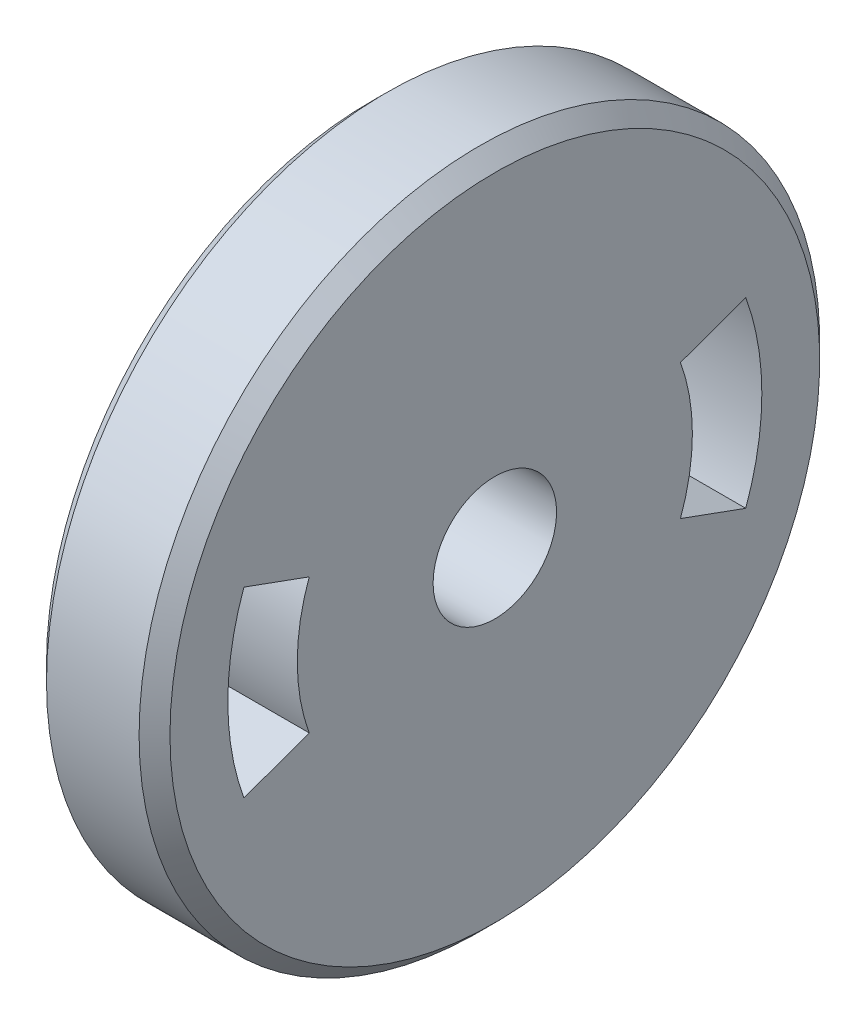
ISO-10303-21;
HEADER;
FILE_DESCRIPTION(('STEP AP214'),'2;1');
FILE_NAME('part.step','',(''),(''),'','','');
FILE_SCHEMA(('AUTOMOTIVE_DESIGN { 1 0 10303 214 1 1 1 1 }'));
ENDSEC;
DATA;
#1=APPLICATION_CONTEXT('core data for automotive mechanical design processes');
#2=APPLICATION_PROTOCOL_DEFINITION('international standard','automotive_design',2000,#1);
#3=PRODUCT_CONTEXT('',#1,'mechanical');
#4=PRODUCT('Part','Part','',(#3));
#5=PRODUCT_RELATED_PRODUCT_CATEGORY('part','',(#4));
#6=PRODUCT_DEFINITION_FORMATION('','',#4);
#7=PRODUCT_DEFINITION_CONTEXT('part definition',#1,'design');
#8=PRODUCT_DEFINITION('design','',#6,#7);
#9=PRODUCT_DEFINITION_SHAPE('','',#8);
#10=(LENGTH_UNIT() NAMED_UNIT(*) SI_UNIT(.MILLI.,.METRE.));
#11=(NAMED_UNIT(*) PLANE_ANGLE_UNIT() SI_UNIT($,.RADIAN.));
#12=(NAMED_UNIT(*) SI_UNIT($,.STERADIAN.) SOLID_ANGLE_UNIT());
#13=UNCERTAINTY_MEASURE_WITH_UNIT(LENGTH_MEASURE(1.E-05),#10,'distance_accuracy_value','');
#14=(GEOMETRIC_REPRESENTATION_CONTEXT(3) GLOBAL_UNCERTAINTY_ASSIGNED_CONTEXT((#13)) GLOBAL_UNIT_ASSIGNED_CONTEXT((#10,
#11,#12)) REPRESENTATION_CONTEXT('',''));
#15=CARTESIAN_POINT('',(0.,0.,0.));
#16=DIRECTION('',(0.,0.,1.));
#17=DIRECTION('',(1.,0.,0.));
#18=AXIS2_PLACEMENT_3D('',#15,#16,#17);
#19=CARTESIAN_POINT('',(-8.,0.,25.));
#20=DIRECTION('',(-1.,0.,0.));
#21=DIRECTION('',(0.,0.,1.));
#22=AXIS2_PLACEMENT_3D('',#19,#20,#21);
#23=PLANE('',#22);
#24=DIRECTION('',(0.,1.,0.));
#25=VECTOR('',#24,1.);
#26=CARTESIAN_POINT('',(-8.,0.,33.));
#27=LINE('',#26,#25);
#28=CARTESIAN_POINT('',(-8.,9.70000000000006,33.));
#29=VERTEX_POINT('',#28);
#30=CARTESIAN_POINT('',(-8.,-12.2999999999999,33.));
#31=VERTEX_POINT('',#30);
#32=EDGE_CURVE('E349',#29,#31,#27,.F.);
#33=ORIENTED_EDGE('',*,*,#32,.T.);
#34=DIRECTION('',(0.,0.,1.));
#35=VECTOR('',#34,1.);
#36=CARTESIAN_POINT('',(-8.,-12.2999999999999,25.));
#37=LINE('',#36,#35);
#38=CARTESIAN_POINT('',(-8.,-12.2999999999999,17.));
#39=VERTEX_POINT('',#38);
#40=EDGE_CURVE('E351',#31,#39,#37,.F.);
#41=ORIENTED_EDGE('',*,*,#40,.T.);
#42=DIRECTION('',(0.,-1.,0.));
#43=VECTOR('',#42,1.);
#44=CARTESIAN_POINT('',(-8.,0.,17.));
#45=LINE('',#44,#43);
#46=CARTESIAN_POINT('',(-8.,9.70000000000005,17.));
#47=VERTEX_POINT('',#46);
#48=EDGE_CURVE('E345',#39,#47,#45,.F.);
#49=ORIENTED_EDGE('',*,*,#48,.T.);
#50=DIRECTION('',(0.,0.,-1.));
#51=VECTOR('',#50,1.);
#52=CARTESIAN_POINT('',(-8.,9.70000000000006,25.));
#53=LINE('',#52,#51);
#54=EDGE_CURVE('E347',#47,#29,#53,.F.);
#55=ORIENTED_EDGE('',*,*,#54,.T.);
#56=EDGE_LOOP('',(#33,#41,#49,#55));
#57=FACE_BOUND('',#56,.T.);
#58=CARTESIAN_POINT('',(-8.,0.,25.));
#59=DIRECTION('',(-1.,0.,0.));
#60=DIRECTION('',(0.,0.,1.));
#61=AXIS2_PLACEMENT_3D('',#58,#59,#60);
#62=CIRCLE('',#61,17.2997868471576);
#63=CARTESIAN_POINT('',(-8.,-5.9168755769682,41.2564820414431));
#64=VERTEX_POINT('',#63);
#65=CARTESIAN_POINT('',(-8.,5.91687557696842,41.2564820414431));
#66=VERTEX_POINT('',#65);
#67=EDGE_CURVE('E314',#64,#66,#62,.T.);
#68=ORIENTED_EDGE('',*,*,#67,.F.);
#69=DIRECTION('',(0.,-0.342020143325663,0.939692620785911));
#70=VECTOR('',#69,1.);
#71=CARTESIAN_POINT('',(-8.,-4.37778493200272,37.0278652479065));
#72=LINE('',#71,#70);
#73=CARTESIAN_POINT('',(-8.,-4.37778493200272,37.0278652479065));
#74=VERTEX_POINT('',#73);
#75=EDGE_CURVE('E300',#74,#64,#72,.T.);
#76=ORIENTED_EDGE('',*,*,#75,.F.);
#77=CARTESIAN_POINT('',(-8.,0.,25.));
#78=DIRECTION('',(1.,0.,0.));
#79=DIRECTION('',(0.,0.,1.));
#80=AXIS2_PLACEMENT_3D('',#77,#78,#79);
#81=CIRCLE('',#80,12.7997868471576);
#82=CARTESIAN_POINT('',(-8.,4.37778493200291,37.0278652479065));
#83=VERTEX_POINT('',#82);
#84=EDGE_CURVE('E308',#83,#74,#81,.T.);
#85=ORIENTED_EDGE('',*,*,#84,.F.);
#86=DIRECTION('',(0.,-0.342020143325669,-0.939692620785908));
#87=VECTOR('',#86,1.);
#88=CARTESIAN_POINT('',(-8.,4.37778493200291,37.0278652479065));
#89=LINE('',#88,#87);
#90=EDGE_CURVE('E311',#66,#83,#89,.T.);
#91=ORIENTED_EDGE('',*,*,#90,.F.);
#92=EDGE_LOOP('',(#68,#76,#85,#91));
#93=FACE_BOUND('',#92,.T.);
#94=CARTESIAN_POINT('',(-8.,0.,25.));
#95=DIRECTION('',(-1.,0.,0.));
#96=DIRECTION('',(0.,0.,1.));
#97=AXIS2_PLACEMENT_3D('',#94,#95,#96);
#98=CIRCLE('',#97,17.2997868471576);
#99=CARTESIAN_POINT('',(-8.,5.91687557696831,8.74351795855688));
#100=VERTEX_POINT('',#99);
#101=CARTESIAN_POINT('',(-8.,-5.91687557696831,8.74351795855693));
#102=VERTEX_POINT('',#101);
#103=EDGE_CURVE('E270',#100,#102,#98,.T.);
#104=ORIENTED_EDGE('',*,*,#103,.F.);
#105=DIRECTION('',(0.,0.342020143325662,-0.939692620785911));
#106=VECTOR('',#105,1.);
#107=CARTESIAN_POINT('',(-8.,4.37778493200283,12.9721347520935));
#108=LINE('',#107,#106);
#109=CARTESIAN_POINT('',(-8.,4.37778493200283,12.9721347520935));
#110=VERTEX_POINT('',#109);
#111=EDGE_CURVE('E278',#110,#100,#108,.T.);
#112=ORIENTED_EDGE('',*,*,#111,.F.);
#113=CARTESIAN_POINT('',(-8.,0.,25.));
#114=DIRECTION('',(1.,0.,0.));
#115=DIRECTION('',(0.,0.,1.));
#116=AXIS2_PLACEMENT_3D('',#113,#114,#115);
#117=CIRCLE('',#116,12.7997868471576);
#118=CARTESIAN_POINT('',(-8.,-4.3777849320028,12.9721347520935));
#119=VERTEX_POINT('',#118);
#120=EDGE_CURVE('E275',#119,#110,#117,.T.);
#121=ORIENTED_EDGE('',*,*,#120,.F.);
#122=DIRECTION('',(0.,0.34202014332567,0.939692620785908));
#123=VECTOR('',#122,1.);
#124=CARTESIAN_POINT('',(-8.,-4.3777849320028,12.9721347520935));
#125=LINE('',#124,#123);
#126=EDGE_CURVE('E272',#102,#119,#125,.T.);
#127=ORIENTED_EDGE('',*,*,#126,.F.);
#128=EDGE_LOOP('',(#104,#112,#121,#127));
#129=FACE_BOUND('',#128,.T.);
#130=CARTESIAN_POINT('',(-8.,0.,25.));
#131=DIRECTION('',(-1.,0.,0.));
#132=DIRECTION('',(0.,0.,1.));
#133=AXIS2_PLACEMENT_3D('',#130,#131,#132);
#134=CIRCLE('',#133,21.0500000000004);
#135=CARTESIAN_POINT('',(-8.,0.,46.0500000000004));
#136=VERTEX_POINT('',#135);
#137=EDGE_CURVE('E334',#136,#136,#134,.T.);
#138=ORIENTED_EDGE('',*,*,#137,.T.);
#139=EDGE_LOOP('',(#138));
#140=FACE_BOUND('',#139,.T.);
#141=ADVANCED_FACE('F45',(#57,#93,#129,#140),#23,.T.);
#142=CARTESIAN_POINT('',(-8.,0.,25.));
#143=DIRECTION('',(1.,0.,0.));
#144=DIRECTION('',(0.,0.,-1.));
#145=AXIS2_PLACEMENT_3D('',#142,#143,#144);
#146=CYLINDRICAL_SURFACE('',#145,22.0500000000004);
#147=CARTESIAN_POINT('',(-1.,0.,25.));
#148=DIRECTION('',(-1.,0.,0.));
#149=DIRECTION('',(0.,0.,1.));
#150=AXIS2_PLACEMENT_3D('',#147,#148,#149);
#151=CIRCLE('',#150,22.0500000000004);
#152=CARTESIAN_POINT('',(-1.,0.,47.0500000000004));
#153=VERTEX_POINT('',#152);
#154=EDGE_CURVE('E328',#153,#153,#151,.T.);
#155=ORIENTED_EDGE('',*,*,#154,.T.);
#156=EDGE_LOOP('',(#155));
#157=FACE_BOUND('',#156,.T.);
#158=CARTESIAN_POINT('',(-7.,0.,25.));
#159=DIRECTION('',(-1.,0.,0.));
#160=DIRECTION('',(0.,0.,1.));
#161=AXIS2_PLACEMENT_3D('',#158,#159,#160);
#162=CIRCLE('',#161,22.0500000000004);
#163=CARTESIAN_POINT('',(-7.,0.,47.0500000000004));
#164=VERTEX_POINT('',#163);
#165=EDGE_CURVE('E325',#164,#164,#162,.F.);
#166=ORIENTED_EDGE('',*,*,#165,.T.);
#167=EDGE_LOOP('',(#166));
#168=FACE_BOUND('',#167,.T.);
#169=ADVANCED_FACE('F430',(#157,#168),#146,.T.);
#170=CARTESIAN_POINT('',(0.,0.,25.));
#171=DIRECTION('',(-1.,0.,0.));
#172=DIRECTION('',(0.,0.,1.));
#173=AXIS2_PLACEMENT_3D('',#170,#171,#172);
#174=PLANE('',#173);
#175=CARTESIAN_POINT('',(0.,0.,25.));
#176=DIRECTION('',(-1.,0.,0.));
#177=DIRECTION('',(0.,0.,1.));
#178=AXIS2_PLACEMENT_3D('',#175,#176,#177);
#179=CIRCLE('',#178,21.0500000000004);
#180=CARTESIAN_POINT('',(0.,0.,46.0500000000004));
#181=VERTEX_POINT('',#180);
#182=EDGE_CURVE('E331',#181,#181,#179,.F.);
#183=ORIENTED_EDGE('',*,*,#182,.T.);
#184=EDGE_LOOP('',(#183));
#185=FACE_BOUND('',#184,.T.);
#186=DIRECTION('',(0.,-0.342020143325662,0.939692620785911));
#187=VECTOR('',#186,1.);
#188=CARTESIAN_POINT('',(0.,4.37778493200283,12.9721347520935));
#189=LINE('',#188,#187);
#190=CARTESIAN_POINT('',(0.,5.91687557696831,8.74351795855688));
#191=VERTEX_POINT('',#190);
#192=CARTESIAN_POINT('',(0.,4.37778493200283,12.9721347520935));
#193=VERTEX_POINT('',#192);
#194=EDGE_CURVE('E263',#191,#193,#189,.T.);
#195=ORIENTED_EDGE('',*,*,#194,.F.);
#196=CARTESIAN_POINT('',(0.,0.,25.));
#197=DIRECTION('',(-1.,0.,0.));
#198=DIRECTION('',(0.,0.,1.));
#199=AXIS2_PLACEMENT_3D('',#196,#197,#198);
#200=CIRCLE('',#199,17.2997868471576);
#201=CARTESIAN_POINT('',(0.,-5.91687557696831,8.74351795855692));
#202=VERTEX_POINT('',#201);
#203=EDGE_CURVE('E267',#202,#191,#200,.F.);
#204=ORIENTED_EDGE('',*,*,#203,.F.);
#205=DIRECTION('',(0.,-0.34202014332567,-0.939692620785908));
#206=VECTOR('',#205,1.);
#207=CARTESIAN_POINT('',(0.,-4.3777849320028,12.9721347520935));
#208=LINE('',#207,#206);
#209=CARTESIAN_POINT('',(0.,-4.3777849320028,12.9721347520935));
#210=VERTEX_POINT('',#209);
#211=EDGE_CURVE('E284',#210,#202,#208,.T.);
#212=ORIENTED_EDGE('',*,*,#211,.F.);
#213=CARTESIAN_POINT('',(0.,0.,25.));
#214=DIRECTION('',(-1.,0.,0.));
#215=DIRECTION('',(0.,0.,1.));
#216=AXIS2_PLACEMENT_3D('',#213,#214,#215);
#217=CIRCLE('',#216,12.7997868471576);
#218=EDGE_CURVE('E261',#193,#210,#217,.T.);
#219=ORIENTED_EDGE('',*,*,#218,.F.);
#220=EDGE_LOOP('',(#195,#204,#212,#219));
#221=FACE_BOUND('',#220,.T.);
#222=DIRECTION('',(0.,0.342020143325662,-0.939692620785911));
#223=VECTOR('',#222,1.);
#224=CARTESIAN_POINT('',(0.,-4.37778493200272,37.0278652479065));
#225=LINE('',#224,#223);
#226=CARTESIAN_POINT('',(0.,-5.9168755769682,41.2564820414431));
#227=VERTEX_POINT('',#226);
#228=CARTESIAN_POINT('',(0.,-4.37778493200272,37.0278652479065));
#229=VERTEX_POINT('',#228);
#230=EDGE_CURVE('E319',#227,#229,#225,.T.);
#231=ORIENTED_EDGE('',*,*,#230,.F.);
#232=CARTESIAN_POINT('',(0.,0.,25.));
#233=DIRECTION('',(-1.,0.,0.));
#234=DIRECTION('',(0.,0.,1.));
#235=AXIS2_PLACEMENT_3D('',#232,#233,#234);
#236=CIRCLE('',#235,17.2997868471576);
#237=CARTESIAN_POINT('',(0.,5.91687557696842,41.2564820414431));
#238=VERTEX_POINT('',#237);
#239=EDGE_CURVE('E316',#238,#227,#236,.F.);
#240=ORIENTED_EDGE('',*,*,#239,.F.);
#241=DIRECTION('',(0.,0.342020143325669,0.939692620785908));
#242=VECTOR('',#241,1.);
#243=CARTESIAN_POINT('',(0.,4.37778493200291,37.0278652479065));
#244=LINE('',#243,#242);
#245=CARTESIAN_POINT('',(0.,4.37778493200291,37.0278652479065));
#246=VERTEX_POINT('',#245);
#247=EDGE_CURVE('E260',#246,#238,#244,.T.);
#248=ORIENTED_EDGE('',*,*,#247,.F.);
#249=CARTESIAN_POINT('',(0.,0.,25.));
#250=DIRECTION('',(-1.,0.,0.));
#251=DIRECTION('',(0.,0.,1.));
#252=AXIS2_PLACEMENT_3D('',#249,#250,#251);
#253=CIRCLE('',#252,12.7997868471576);
#254=EDGE_CURVE('E264',#229,#246,#253,.T.);
#255=ORIENTED_EDGE('',*,*,#254,.F.);
#256=EDGE_LOOP('',(#231,#240,#248,#255));
#257=FACE_BOUND('',#256,.T.);
#258=CARTESIAN_POINT('',(0.,0.,25.));
#259=DIRECTION('',(-1.,0.,0.));
#260=DIRECTION('',(0.,0.,1.));
#261=AXIS2_PLACEMENT_3D('',#258,#259,#260);
#262=CIRCLE('',#261,4.);
#263=CARTESIAN_POINT('',(0.,0.,29.));
#264=VERTEX_POINT('',#263);
#265=EDGE_CURVE('E293',#264,#264,#262,.F.);
#266=ORIENTED_EDGE('',*,*,#265,.F.);
#267=EDGE_LOOP('',(#266));
#268=FACE_BOUND('',#267,.T.);
#269=ADVANCED_FACE('F438',(#185,#221,#257,#268),#174,.F.);
#270=CARTESIAN_POINT('',(0.000999999999999265,0.,25.));
#271=DIRECTION('',(-1.,0.,0.));
#272=DIRECTION('',(0.,0.,1.));
#273=AXIS2_PLACEMENT_3D('',#270,#271,#272);
#274=CYLINDRICAL_SURFACE('',#273,4.);
#275=CARTESIAN_POINT('',(-14.,0.,25.));
#276=DIRECTION('',(-1.,0.,0.));
#277=DIRECTION('',(0.,0.,1.));
#278=AXIS2_PLACEMENT_3D('',#275,#276,#277);
#279=CIRCLE('',#278,4.);
#280=CARTESIAN_POINT('',(-14.,2.75000000000006,27.9047375096555));
#281=VERTEX_POINT('',#280);
#282=CARTESIAN_POINT('',(-14.,2.75000000000006,22.0952624903445));
#283=VERTEX_POINT('',#282);
#284=EDGE_CURVE('E239',#281,#283,#279,.T.);
#285=ORIENTED_EDGE('',*,*,#284,.T.);
#286=DIRECTION('',(-1.,0.,0.));
#287=VECTOR('',#286,1.);
#288=CARTESIAN_POINT('',(0.000999999999999265,2.75000000000006,22.0952624903445));
#289=LINE('',#288,#287);
#290=CARTESIAN_POINT('',(-12.,2.75000000000006,22.0952624903445));
#291=VERTEX_POINT('',#290);
#292=EDGE_CURVE('E236',#283,#291,#289,.F.);
#293=ORIENTED_EDGE('',*,*,#292,.T.);
#294=CARTESIAN_POINT('',(-12.,0.,25.));
#295=DIRECTION('',(1.,0.,0.));
#296=DIRECTION('',(0.,0.,-1.));
#297=AXIS2_PLACEMENT_3D('',#294,#295,#296);
#298=CIRCLE('',#297,4.);
#299=CARTESIAN_POINT('',(-12.,2.75000000000006,27.9047375096555));
#300=VERTEX_POINT('',#299);
#301=EDGE_CURVE('E339',#291,#300,#298,.F.);
#302=ORIENTED_EDGE('',*,*,#301,.T.);
#303=DIRECTION('',(-1.,0.,0.));
#304=VECTOR('',#303,1.);
#305=CARTESIAN_POINT('',(0.000999999999999265,2.75000000000006,27.9047375096555));
#306=LINE('',#305,#304);
#307=EDGE_CURVE('E230',#300,#281,#306,.T.);
#308=ORIENTED_EDGE('',*,*,#307,.T.);
#309=EDGE_LOOP('',(#285,#293,#302,#308));
#310=FACE_BOUND('',#309,.T.);
#311=ORIENTED_EDGE('',*,*,#265,.T.);
#312=EDGE_LOOP('',(#311));
#313=FACE_BOUND('',#312,.T.);
#314=ADVANCED_FACE('F444',(#310,#313),#274,.F.);
#315=CARTESIAN_POINT('',(0.000999999999999265,0.,25.));
#316=DIRECTION('',(-1.,0.,0.));
#317=DIRECTION('',(0.,0.,1.));
#318=AXIS2_PLACEMENT_3D('',#315,#316,#317);
#319=CYLINDRICAL_SURFACE('',#318,17.2997868471576);
#320=ORIENTED_EDGE('',*,*,#239,.T.);
#321=DIRECTION('',(-1.,0.,0.));
#322=VECTOR('',#321,1.);
#323=CARTESIAN_POINT('',(0.000999999999999265,-5.9168755769682,41.2564820414431));
#324=LINE('',#323,#322);
#325=EDGE_CURVE('E296',#227,#64,#324,.T.);
#326=ORIENTED_EDGE('',*,*,#325,.T.);
#327=ORIENTED_EDGE('',*,*,#67,.T.);
#328=DIRECTION('',(-1.,0.,0.));
#329=VECTOR('',#328,1.);
#330=CARTESIAN_POINT('',(0.000999999999999265,5.91687557696842,41.2564820414431));
#331=LINE('',#330,#329);
#332=EDGE_CURVE('E297',#238,#66,#331,.T.);
#333=ORIENTED_EDGE('',*,*,#332,.F.);
#334=EDGE_LOOP('',(#320,#326,#327,#333));
#335=FACE_BOUND('',#334,.T.);
#336=ADVANCED_FACE('F479',(#335),#319,.F.);
#337=CARTESIAN_POINT('',(0.000999999999999265,-4.37778493200272,37.0278652479065));
#338=DIRECTION('',(0.,-0.939692620785911,-0.342020143325662));
#339=DIRECTION('',(0.,0.342020143325662,-0.939692620785911));
#340=AXIS2_PLACEMENT_3D('',#337,#338,#339);
#341=PLANE('',#340);
#342=ORIENTED_EDGE('',*,*,#230,.T.);
#343=DIRECTION('',(-1.,0.,0.));
#344=VECTOR('',#343,1.);
#345=CARTESIAN_POINT('',(0.000999999999999265,-4.37778493200272,37.0278652479065));
#346=LINE('',#345,#344);
#347=EDGE_CURVE('E303',#229,#74,#346,.T.);
#348=ORIENTED_EDGE('',*,*,#347,.T.);
#349=ORIENTED_EDGE('',*,*,#75,.T.);
#350=ORIENTED_EDGE('',*,*,#325,.F.);
#351=EDGE_LOOP('',(#342,#348,#349,#350));
#352=FACE_BOUND('',#351,.T.);
#353=ADVANCED_FACE('F685',(#352),#341,.F.);
#354=CARTESIAN_POINT('',(0.000999999999999265,0.,25.));
#355=DIRECTION('',(-1.,0.,0.));
#356=DIRECTION('',(0.,0.,1.));
#357=AXIS2_PLACEMENT_3D('',#354,#355,#356);
#358=CYLINDRICAL_SURFACE('',#357,12.7997868471576);
#359=ORIENTED_EDGE('',*,*,#254,.T.);
#360=DIRECTION('',(-1.,0.,0.));
#361=VECTOR('',#360,1.);
#362=CARTESIAN_POINT('',(0.000999999999999265,4.37778493200291,37.0278652479065));
#363=LINE('',#362,#361);
#364=EDGE_CURVE('E301',#246,#83,#363,.T.);
#365=ORIENTED_EDGE('',*,*,#364,.T.);
#366=ORIENTED_EDGE('',*,*,#84,.T.);
#367=ORIENTED_EDGE('',*,*,#347,.F.);
#368=EDGE_LOOP('',(#359,#365,#366,#367));
#369=FACE_BOUND('',#368,.T.);
#370=ADVANCED_FACE('F676',(#369),#358,.T.);
#371=CARTESIAN_POINT('',(0.000999999999999265,4.37778493200291,37.0278652479065));
#372=DIRECTION('',(0.,0.939692620785908,-0.342020143325669));
#373=DIRECTION('',(0.,0.342020143325669,0.939692620785908));
#374=AXIS2_PLACEMENT_3D('',#371,#372,#373);
#375=PLANE('',#374);
#376=ORIENTED_EDGE('',*,*,#247,.T.);
#377=ORIENTED_EDGE('',*,*,#332,.T.);
#378=ORIENTED_EDGE('',*,*,#90,.T.);
#379=ORIENTED_EDGE('',*,*,#364,.F.);
#380=EDGE_LOOP('',(#376,#377,#378,#379));
#381=FACE_BOUND('',#380,.T.);
#382=ADVANCED_FACE('F667',(#381),#375,.F.);
#383=CARTESIAN_POINT('',(0.000999999999999265,0.,25.));
#384=DIRECTION('',(-1.,0.,0.));
#385=DIRECTION('',(0.,0.,1.));
#386=AXIS2_PLACEMENT_3D('',#383,#384,#385);
#387=CYLINDRICAL_SURFACE('',#386,17.2997868471576);
#388=ORIENTED_EDGE('',*,*,#203,.T.);
#389=DIRECTION('',(-1.,0.,0.));
#390=VECTOR('',#389,1.);
#391=CARTESIAN_POINT('',(0.000999999999999265,5.91687557696831,8.74351795855688));
#392=LINE('',#391,#390);
#393=EDGE_CURVE('E282',#191,#100,#392,.T.);
#394=ORIENTED_EDGE('',*,*,#393,.T.);
#395=ORIENTED_EDGE('',*,*,#103,.T.);
#396=DIRECTION('',(-1.,0.,0.));
#397=VECTOR('',#396,1.);
#398=CARTESIAN_POINT('',(0.000999999999999265,-5.91687557696831,8.74351795855692));
#399=LINE('',#398,#397);
#400=EDGE_CURVE('E281',#202,#102,#399,.T.);
#401=ORIENTED_EDGE('',*,*,#400,.F.);
#402=EDGE_LOOP('',(#388,#394,#395,#401));
#403=FACE_BOUND('',#402,.T.);
#404=ADVANCED_FACE('F658',(#403),#387,.F.);
#405=CARTESIAN_POINT('',(0.000999999999999265,4.37778493200283,12.9721347520935));
#406=DIRECTION('',(0.,0.939692620785911,0.342020143325662));
#407=DIRECTION('',(0.,-0.342020143325662,0.939692620785911));
#408=AXIS2_PLACEMENT_3D('',#405,#406,#407);
#409=PLANE('',#408);
#410=ORIENTED_EDGE('',*,*,#194,.T.);
#411=DIRECTION('',(-1.,0.,0.));
#412=VECTOR('',#411,1.);
#413=CARTESIAN_POINT('',(0.000999999999999265,4.37778493200283,12.9721347520935));
#414=LINE('',#413,#412);
#415=EDGE_CURVE('E285',#193,#110,#414,.T.);
#416=ORIENTED_EDGE('',*,*,#415,.T.);
#417=ORIENTED_EDGE('',*,*,#111,.T.);
#418=ORIENTED_EDGE('',*,*,#393,.F.);
#419=EDGE_LOOP('',(#410,#416,#417,#418));
#420=FACE_BOUND('',#419,.T.);
#421=ADVANCED_FACE('F649',(#420),#409,.F.);
#422=CARTESIAN_POINT('',(0.000999999999999265,0.,25.));
#423=DIRECTION('',(-1.,0.,0.));
#424=DIRECTION('',(0.,0.,1.));
#425=AXIS2_PLACEMENT_3D('',#422,#423,#424);
#426=CYLINDRICAL_SURFACE('',#425,12.7997868471576);
#427=ORIENTED_EDGE('',*,*,#218,.T.);
#428=DIRECTION('',(-1.,0.,0.));
#429=VECTOR('',#428,1.);
#430=CARTESIAN_POINT('',(0.000999999999999265,-4.3777849320028,12.9721347520935));
#431=LINE('',#430,#429);
#432=EDGE_CURVE('E287',#210,#119,#431,.T.);
#433=ORIENTED_EDGE('',*,*,#432,.T.);
#434=ORIENTED_EDGE('',*,*,#120,.T.);
#435=ORIENTED_EDGE('',*,*,#415,.F.);
#436=EDGE_LOOP('',(#427,#433,#434,#435));
#437=FACE_BOUND('',#436,.T.);
#438=ADVANCED_FACE('F640',(#437),#426,.T.);
#439=CARTESIAN_POINT('',(0.000999999999999265,-4.3777849320028,12.9721347520935));
#440=DIRECTION('',(0.,-0.939692620785908,0.34202014332567));
#441=DIRECTION('',(0.,-0.34202014332567,-0.939692620785908));
#442=AXIS2_PLACEMENT_3D('',#439,#440,#441);
#443=PLANE('',#442);
#444=ORIENTED_EDGE('',*,*,#211,.T.);
#445=ORIENTED_EDGE('',*,*,#400,.T.);
#446=ORIENTED_EDGE('',*,*,#126,.T.);
#447=ORIENTED_EDGE('',*,*,#432,.F.);
#448=EDGE_LOOP('',(#444,#445,#446,#447));
#449=FACE_BOUND('',#448,.T.);
#450=ADVANCED_FACE('F456',(#449),#443,.F.);
#451=CARTESIAN_POINT('',(-1.,0.,25.));
#452=DIRECTION('',(-1.,0.,0.));
#453=DIRECTION('',(0.,0.,1.));
#454=AXIS2_PLACEMENT_3D('',#451,#452,#453);
#455=CONICAL_SURFACE('',#454,22.0500000000004,0.785398163397447);
#456=ORIENTED_EDGE('',*,*,#182,.F.);
#457=EDGE_LOOP('',(#456));
#458=FACE_BOUND('',#457,.T.);
#459=ORIENTED_EDGE('',*,*,#154,.F.);
#460=EDGE_LOOP('',(#459));
#461=FACE_BOUND('',#460,.T.);
#462=ADVANCED_FACE('F450',(#458,#461),#455,.T.);
#463=CARTESIAN_POINT('',(-8.,0.,25.));
#464=DIRECTION('',(1.,0.,0.));
#465=DIRECTION('',(0.,0.,-1.));
#466=AXIS2_PLACEMENT_3D('',#463,#464,#465);
#467=CONICAL_SURFACE('',#466,21.0500000000004,0.785398163397447);
#468=ORIENTED_EDGE('',*,*,#165,.F.);
#469=EDGE_LOOP('',(#468));
#470=FACE_BOUND('',#469,.T.);
#471=ORIENTED_EDGE('',*,*,#137,.F.);
#472=EDGE_LOOP('',(#471));
#473=FACE_BOUND('',#472,.T.);
#474=ADVANCED_FACE('F396',(#470,#473),#467,.T.);
#475=CARTESIAN_POINT('',(-14.,0.,0.));
#476=DIRECTION('',(-1.,0.,0.));
#477=DIRECTION('',(0.,0.,1.));
#478=AXIS2_PLACEMENT_3D('',#475,#476,#477);
#479=PLANE('',#478);
#480=CARTESIAN_POINT('',(-14.,5.94999999999857,25.));
#481=DIRECTION('',(-1.,0.,0.));
#482=DIRECTION('',(0.,0.,1.));
#483=AXIS2_PLACEMENT_3D('',#480,#481,#482);
#484=CIRCLE('',#483,1.25);
#485=CARTESIAN_POINT('',(-14.,5.94999999999857,26.25));
#486=VERTEX_POINT('',#485);
#487=EDGE_CURVE('E374',#486,#486,#484,.T.);
#488=ORIENTED_EDGE('',*,*,#487,.F.);
#489=EDGE_LOOP('',(#488));
#490=FACE_BOUND('',#489,.T.);
#491=CARTESIAN_POINT('',(-14.,-8.54999999999961,25.));
#492=DIRECTION('',(-1.,0.,0.));
#493=DIRECTION('',(0.,0.,1.));
#494=AXIS2_PLACEMENT_3D('',#491,#492,#493);
#495=CIRCLE('',#494,1.25);
#496=CARTESIAN_POINT('',(-14.,-8.54999999999961,26.25));
#497=VERTEX_POINT('',#496);
#498=EDGE_CURVE('E370',#497,#497,#495,.T.);
#499=ORIENTED_EDGE('',*,*,#498,.F.);
#500=EDGE_LOOP('',(#499));
#501=FACE_BOUND('',#500,.T.);
#502=DIRECTION('',(0.,0.,-1.));
#503=VECTOR('',#502,1.);
#504=CARTESIAN_POINT('',(-14.,2.75000000000006,0.));
#505=LINE('',#504,#503);
#506=CARTESIAN_POINT('',(-14.,2.75000000000006,18.95));
#507=VERTEX_POINT('',#506);
#508=EDGE_CURVE('E337',#283,#507,#505,.T.);
#509=ORIENTED_EDGE('',*,*,#508,.F.);
#510=ORIENTED_EDGE('',*,*,#284,.F.);
#511=DIRECTION('',(0.,0.,-1.));
#512=VECTOR('',#511,1.);
#513=CARTESIAN_POINT('',(-14.,2.75000000000006,18.95));
#514=LINE('',#513,#512);
#515=CARTESIAN_POINT('',(-14.,2.75000000000006,31.05));
#516=VERTEX_POINT('',#515);
#517=EDGE_CURVE('E211',#516,#281,#514,.T.);
#518=ORIENTED_EDGE('',*,*,#517,.F.);
#519=DIRECTION('',(0.,1.,0.));
#520=VECTOR('',#519,1.);
#521=CARTESIAN_POINT('',(-14.,-5.34999999999994,31.05));
#522=LINE('',#521,#520);
#523=CARTESIAN_POINT('',(-14.,-5.34999999999994,31.05));
#524=VERTEX_POINT('',#523);
#525=EDGE_CURVE('E213',#524,#516,#522,.T.);
#526=ORIENTED_EDGE('',*,*,#525,.F.);
#527=DIRECTION('',(0.,0.,1.));
#528=VECTOR('',#527,1.);
#529=CARTESIAN_POINT('',(-14.,-5.34999999999994,18.95));
#530=LINE('',#529,#528);
#531=CARTESIAN_POINT('',(-14.,-5.34999999999994,18.95));
#532=VERTEX_POINT('',#531);
#533=EDGE_CURVE('E223',#532,#524,#530,.T.);
#534=ORIENTED_EDGE('',*,*,#533,.F.);
#535=DIRECTION('',(0.,-1.,0.));
#536=VECTOR('',#535,1.);
#537=CARTESIAN_POINT('',(-14.,-5.34999999999994,18.95));
#538=LINE('',#537,#536);
#539=EDGE_CURVE('E192',#507,#532,#538,.T.);
#540=ORIENTED_EDGE('',*,*,#539,.F.);
#541=EDGE_LOOP('',(#509,#510,#518,#526,#534,#540));
#542=FACE_BOUND('',#541,.T.);
#543=DIRECTION('',(0.,1.,0.));
#544=VECTOR('',#543,1.);
#545=CARTESIAN_POINT('',(-14.,-11.2999999999999,32.));
#546=LINE('',#545,#544);
#547=CARTESIAN_POINT('',(-14.,-11.2999999999999,32.));
#548=VERTEX_POINT('',#547);
#549=CARTESIAN_POINT('',(-14.,8.70000000000006,32.));
#550=VERTEX_POINT('',#549);
#551=EDGE_CURVE('E242',#548,#550,#546,.T.);
#552=ORIENTED_EDGE('',*,*,#551,.T.);
#553=DIRECTION('',(0.,0.,-1.));
#554=VECTOR('',#553,1.);
#555=CARTESIAN_POINT('',(-14.,8.70000000000006,32.));
#556=LINE('',#555,#554);
#557=CARTESIAN_POINT('',(-14.,8.70000000000005,18.));
#558=VERTEX_POINT('',#557);
#559=EDGE_CURVE('E245',#550,#558,#556,.T.);
#560=ORIENTED_EDGE('',*,*,#559,.T.);
#561=DIRECTION('',(0.,-1.,0.));
#562=VECTOR('',#561,1.);
#563=CARTESIAN_POINT('',(-14.,-11.2999999999999,18.));
#564=LINE('',#563,#562);
#565=CARTESIAN_POINT('',(-14.,-11.2999999999999,18.));
#566=VERTEX_POINT('',#565);
#567=EDGE_CURVE('E247',#558,#566,#564,.T.);
#568=ORIENTED_EDGE('',*,*,#567,.T.);
#569=DIRECTION('',(0.,0.,1.));
#570=VECTOR('',#569,1.);
#571=CARTESIAN_POINT('',(-14.,-11.2999999999999,32.));
#572=LINE('',#571,#570);
#573=EDGE_CURVE('E249',#566,#548,#572,.T.);
#574=ORIENTED_EDGE('',*,*,#573,.T.);
#575=EDGE_LOOP('',(#552,#560,#568,#574));
#576=FACE_BOUND('',#575,.T.);
#577=ADVANCED_FACE('F392',(#490,#501,#542,#576),#479,.T.);
#578=CARTESIAN_POINT('',(-14.,-11.2999999999999,32.));
#579=DIRECTION('',(0.,0.,-1.));
#580=DIRECTION('',(-1.,0.,0.));
#581=AXIS2_PLACEMENT_3D('',#578,#579,#580);
#582=PLANE('',#581);
#583=DIRECTION('',(1.,0.,0.));
#584=VECTOR('',#583,1.);
#585=CARTESIAN_POINT('',(-14.,-11.2999999999999,32.));
#586=LINE('',#585,#584);
#587=CARTESIAN_POINT('',(-9.,-11.2999999999999,32.));
#588=VERTEX_POINT('',#587);
#589=EDGE_CURVE('E251',#548,#588,#586,.T.);
#590=ORIENTED_EDGE('',*,*,#589,.T.);
#591=DIRECTION('',(0.,1.,0.));
#592=VECTOR('',#591,1.);
#593=CARTESIAN_POINT('',(-9.,-11.2999999999999,32.));
#594=LINE('',#593,#592);
#595=CARTESIAN_POINT('',(-9.,8.70000000000006,32.));
#596=VERTEX_POINT('',#595);
#597=EDGE_CURVE('E69',#588,#596,#594,.T.);
#598=ORIENTED_EDGE('',*,*,#597,.T.);
#599=DIRECTION('',(1.,0.,0.));
#600=VECTOR('',#599,1.);
#601=CARTESIAN_POINT('',(-14.,8.70000000000006,32.));
#602=LINE('',#601,#600);
#603=EDGE_CURVE('E258',#550,#596,#602,.T.);
#604=ORIENTED_EDGE('',*,*,#603,.F.);
#605=ORIENTED_EDGE('',*,*,#551,.F.);
#606=EDGE_LOOP('',(#590,#598,#604,#605));
#607=FACE_BOUND('',#606,.T.);
#608=ADVANCED_FACE('F395',(#607),#582,.F.);
#609=CARTESIAN_POINT('',(-14.,8.70000000000006,32.));
#610=DIRECTION('',(0.,-1.,0.));
#611=DIRECTION('',(0.,0.,-1.));
#612=AXIS2_PLACEMENT_3D('',#609,#610,#611);
#613=PLANE('',#612);
#614=ORIENTED_EDGE('',*,*,#603,.T.);
#615=DIRECTION('',(0.,0.,-1.));
#616=VECTOR('',#615,1.);
#617=CARTESIAN_POINT('',(-9.,8.70000000000006,32.));
#618=LINE('',#617,#616);
#619=CARTESIAN_POINT('',(-9.,8.70000000000005,18.));
#620=VERTEX_POINT('',#619);
#621=EDGE_CURVE('E54',#596,#620,#618,.T.);
#622=ORIENTED_EDGE('',*,*,#621,.T.);
#623=DIRECTION('',(1.,0.,0.));
#624=VECTOR('',#623,1.);
#625=CARTESIAN_POINT('',(-14.,8.70000000000005,18.));
#626=LINE('',#625,#624);
#627=EDGE_CURVE('E256',#558,#620,#626,.T.);
#628=ORIENTED_EDGE('',*,*,#627,.F.);
#629=ORIENTED_EDGE('',*,*,#559,.F.);
#630=EDGE_LOOP('',(#614,#622,#628,#629));
#631=FACE_BOUND('',#630,.T.);
#632=ADVANCED_FACE('F405',(#631),#613,.F.);
#633=CARTESIAN_POINT('',(-14.,-11.2999999999999,18.));
#634=DIRECTION('',(0.,0.,1.));
#635=DIRECTION('',(1.,0.,0.));
#636=AXIS2_PLACEMENT_3D('',#633,#634,#635);
#637=PLANE('',#636);
#638=ORIENTED_EDGE('',*,*,#627,.T.);
#639=DIRECTION('',(0.,-1.,0.));
#640=VECTOR('',#639,1.);
#641=CARTESIAN_POINT('',(-9.,-11.2999999999999,18.));
#642=LINE('',#641,#640);
#643=CARTESIAN_POINT('',(-9.,-11.2999999999999,18.));
#644=VERTEX_POINT('',#643);
#645=EDGE_CURVE('E13',#620,#644,#642,.T.);
#646=ORIENTED_EDGE('',*,*,#645,.T.);
#647=DIRECTION('',(1.,0.,0.));
#648=VECTOR('',#647,1.);
#649=CARTESIAN_POINT('',(-14.,-11.2999999999999,18.));
#650=LINE('',#649,#648);
#651=EDGE_CURVE('E253',#566,#644,#650,.T.);
#652=ORIENTED_EDGE('',*,*,#651,.F.);
#653=ORIENTED_EDGE('',*,*,#567,.F.);
#654=EDGE_LOOP('',(#638,#646,#652,#653));
#655=FACE_BOUND('',#654,.T.);
#656=ADVANCED_FACE('F413',(#655),#637,.F.);
#657=CARTESIAN_POINT('',(-14.,-11.2999999999999,32.));
#658=DIRECTION('',(0.,1.,0.));
#659=DIRECTION('',(0.,0.,1.));
#660=AXIS2_PLACEMENT_3D('',#657,#658,#659);
#661=PLANE('',#660);
#662=ORIENTED_EDGE('',*,*,#651,.T.);
#663=DIRECTION('',(0.,0.,1.));
#664=VECTOR('',#663,1.);
#665=CARTESIAN_POINT('',(-9.,-11.2999999999999,32.));
#666=LINE('',#665,#664);
#667=EDGE_CURVE('E342',#644,#588,#666,.T.);
#668=ORIENTED_EDGE('',*,*,#667,.T.);
#669=ORIENTED_EDGE('',*,*,#589,.F.);
#670=ORIENTED_EDGE('',*,*,#573,.F.);
#671=EDGE_LOOP('',(#662,#668,#669,#670));
#672=FACE_BOUND('',#671,.T.);
#673=ADVANCED_FACE('F416',(#672),#661,.F.);
#674=CARTESIAN_POINT('',(-12.,0.,0.));
#675=DIRECTION('',(1.,0.,0.));
#676=DIRECTION('',(0.,0.,-1.));
#677=AXIS2_PLACEMENT_3D('',#674,#675,#676);
#678=PLANE('',#677);
#679=DIRECTION('',(0.,0.,-1.));
#680=VECTOR('',#679,1.);
#681=CARTESIAN_POINT('',(-12.,2.75000000000006,18.95));
#682=LINE('',#681,#680);
#683=CARTESIAN_POINT('',(-12.,2.75000000000006,18.95));
#684=VERTEX_POINT('',#683);
#685=EDGE_CURVE('E209',#291,#684,#682,.T.);
#686=ORIENTED_EDGE('',*,*,#685,.T.);
#687=DIRECTION('',(0.,-1.,0.));
#688=VECTOR('',#687,1.);
#689=CARTESIAN_POINT('',(-12.,-5.34999999999994,18.95));
#690=LINE('',#689,#688);
#691=CARTESIAN_POINT('',(-12.,-5.34999999999994,18.95));
#692=VERTEX_POINT('',#691);
#693=EDGE_CURVE('E190',#684,#692,#690,.T.);
#694=ORIENTED_EDGE('',*,*,#693,.T.);
#695=DIRECTION('',(0.,0.,1.));
#696=VECTOR('',#695,1.);
#697=CARTESIAN_POINT('',(-12.,-5.34999999999994,18.95));
#698=LINE('',#697,#696);
#699=CARTESIAN_POINT('',(-12.,-5.34999999999994,31.05));
#700=VERTEX_POINT('',#699);
#701=EDGE_CURVE('E200',#692,#700,#698,.T.);
#702=ORIENTED_EDGE('',*,*,#701,.T.);
#703=DIRECTION('',(0.,1.,0.));
#704=VECTOR('',#703,1.);
#705=CARTESIAN_POINT('',(-12.,-5.34999999999994,31.05));
#706=LINE('',#705,#704);
#707=CARTESIAN_POINT('',(-12.,2.75000000000006,31.05));
#708=VERTEX_POINT('',#707);
#709=EDGE_CURVE('E205',#700,#708,#706,.T.);
#710=ORIENTED_EDGE('',*,*,#709,.T.);
#711=EDGE_CURVE('E197',#708,#300,#682,.T.);
#712=ORIENTED_EDGE('',*,*,#711,.T.);
#713=ORIENTED_EDGE('',*,*,#301,.F.);
#714=EDGE_LOOP('',(#686,#694,#702,#710,#712,#713));
#715=FACE_BOUND('',#714,.T.);
#716=ADVANCED_FACE('F207',(#715),#678,.F.);
#717=CARTESIAN_POINT('',(-12.,2.75000000000006,18.95));
#718=DIRECTION('',(0.,1.,0.));
#719=DIRECTION('',(0.,0.,1.));
#720=AXIS2_PLACEMENT_3D('',#717,#718,#719);
#721=PLANE('',#720);
#722=ORIENTED_EDGE('',*,*,#508,.T.);
#723=DIRECTION('',(-1.,0.,0.));
#724=VECTOR('',#723,1.);
#725=CARTESIAN_POINT('',(-12.,2.75000000000006,18.95));
#726=LINE('',#725,#724);
#727=EDGE_CURVE('E228',#684,#507,#726,.T.);
#728=ORIENTED_EDGE('',*,*,#727,.F.);
#729=ORIENTED_EDGE('',*,*,#685,.F.);
#730=ORIENTED_EDGE('',*,*,#292,.F.);
#731=EDGE_LOOP('',(#722,#728,#729,#730));
#732=FACE_BOUND('',#731,.T.);
#733=ADVANCED_FACE('F488',(#732),#721,.F.);
#734=ORIENTED_EDGE('',*,*,#711,.F.);
#735=DIRECTION('',(-1.,0.,0.));
#736=VECTOR('',#735,1.);
#737=CARTESIAN_POINT('',(-12.,2.75000000000006,31.05));
#738=LINE('',#737,#736);
#739=EDGE_CURVE('E231',#708,#516,#738,.T.);
#740=ORIENTED_EDGE('',*,*,#739,.T.);
#741=ORIENTED_EDGE('',*,*,#517,.T.);
#742=ORIENTED_EDGE('',*,*,#307,.F.);
#743=EDGE_LOOP('',(#734,#740,#741,#742));
#744=FACE_BOUND('',#743,.T.);
#745=ADVANCED_FACE('F497',(#744),#721,.F.);
#746=CARTESIAN_POINT('',(-12.,-5.34999999999994,18.95));
#747=DIRECTION('',(0.,0.,-1.));
#748=DIRECTION('',(-1.,0.,0.));
#749=AXIS2_PLACEMENT_3D('',#746,#747,#748);
#750=PLANE('',#749);
#751=ORIENTED_EDGE('',*,*,#539,.T.);
#752=DIRECTION('',(-1.,0.,0.));
#753=VECTOR('',#752,1.);
#754=CARTESIAN_POINT('',(-12.,-5.34999999999994,18.95));
#755=LINE('',#754,#753);
#756=EDGE_CURVE('E185',#692,#532,#755,.T.);
#757=ORIENTED_EDGE('',*,*,#756,.F.);
#758=ORIENTED_EDGE('',*,*,#693,.F.);
#759=ORIENTED_EDGE('',*,*,#727,.T.);
#760=EDGE_LOOP('',(#751,#757,#758,#759));
#761=FACE_BOUND('',#760,.T.);
#762=ADVANCED_FACE('F187',(#761),#750,.F.);
#763=CARTESIAN_POINT('',(-12.,-5.34999999999994,31.05));
#764=DIRECTION('',(0.,0.,1.));
#765=DIRECTION('',(1.,0.,0.));
#766=AXIS2_PLACEMENT_3D('',#763,#764,#765);
#767=PLANE('',#766);
#768=ORIENTED_EDGE('',*,*,#525,.T.);
#769=ORIENTED_EDGE('',*,*,#739,.F.);
#770=ORIENTED_EDGE('',*,*,#709,.F.);
#771=DIRECTION('',(-1.,0.,0.));
#772=VECTOR('',#771,1.);
#773=CARTESIAN_POINT('',(-12.,-5.34999999999994,31.05));
#774=LINE('',#773,#772);
#775=EDGE_CURVE('E196',#700,#524,#774,.T.);
#776=ORIENTED_EDGE('',*,*,#775,.T.);
#777=EDGE_LOOP('',(#768,#769,#770,#776));
#778=FACE_BOUND('',#777,.T.);
#779=ADVANCED_FACE('F513',(#778),#767,.F.);
#780=CARTESIAN_POINT('',(-12.,-5.34999999999994,18.95));
#781=DIRECTION('',(0.,-1.,0.));
#782=DIRECTION('',(0.,0.,-1.));
#783=AXIS2_PLACEMENT_3D('',#780,#781,#782);
#784=PLANE('',#783);
#785=ORIENTED_EDGE('',*,*,#533,.T.);
#786=ORIENTED_EDGE('',*,*,#775,.F.);
#787=ORIENTED_EDGE('',*,*,#701,.F.);
#788=ORIENTED_EDGE('',*,*,#756,.T.);
#789=EDGE_LOOP('',(#785,#786,#787,#788));
#790=FACE_BOUND('',#789,.T.);
#791=ADVANCED_FACE('F201',(#790),#784,.F.);
#792=CARTESIAN_POINT('',(-6.,-8.54999999999961,25.));
#793=DIRECTION('',(-1.,0.,0.));
#794=DIRECTION('',(0.,0.,1.));
#795=AXIS2_PLACEMENT_3D('',#792,#793,#794);
#796=CYLINDRICAL_SURFACE('',#795,1.25);
#797=CARTESIAN_POINT('',(-6.,-8.54999999999961,25.));
#798=DIRECTION('',(-1.,0.,0.));
#799=DIRECTION('',(0.,0.,1.));
#800=AXIS2_PLACEMENT_3D('',#797,#798,#799);
#801=CIRCLE('',#800,1.25);
#802=CARTESIAN_POINT('',(-6.,-8.54999999999961,26.25));
#803=VERTEX_POINT('',#802);
#804=EDGE_CURVE('E216',#803,#803,#801,.T.);
#805=ORIENTED_EDGE('',*,*,#804,.F.);
#806=EDGE_LOOP('',(#805));
#807=FACE_BOUND('',#806,.T.);
#808=ORIENTED_EDGE('',*,*,#498,.T.);
#809=EDGE_LOOP('',(#808));
#810=FACE_BOUND('',#809,.T.);
#811=ADVANCED_FACE('F528',(#807,#810),#796,.F.);
#812=CARTESIAN_POINT('',(-6.,-8.54999999999961,25.));
#813=DIRECTION('',(-1.,0.,0.));
#814=DIRECTION('',(0.,0.,1.));
#815=AXIS2_PLACEMENT_3D('',#812,#813,#814);
#816=PLANE('',#815);
#817=ORIENTED_EDGE('',*,*,#804,.T.);
#818=EDGE_LOOP('',(#817));
#819=FACE_BOUND('',#818,.T.);
#820=ADVANCED_FACE('F388',(#819),#816,.T.);
#821=CARTESIAN_POINT('',(-6.,5.94999999999857,25.));
#822=DIRECTION('',(-1.,0.,0.));
#823=DIRECTION('',(0.,0.,1.));
#824=AXIS2_PLACEMENT_3D('',#821,#822,#823);
#825=CYLINDRICAL_SURFACE('',#824,1.25);
#826=CARTESIAN_POINT('',(-6.,5.94999999999857,25.));
#827=DIRECTION('',(-1.,0.,0.));
#828=DIRECTION('',(0.,0.,1.));
#829=AXIS2_PLACEMENT_3D('',#826,#827,#828);
#830=CIRCLE('',#829,1.25);
#831=CARTESIAN_POINT('',(-6.,5.94999999999857,26.25));
#832=VERTEX_POINT('',#831);
#833=EDGE_CURVE('E224',#832,#832,#830,.T.);
#834=ORIENTED_EDGE('',*,*,#833,.F.);
#835=EDGE_LOOP('',(#834));
#836=FACE_BOUND('',#835,.T.);
#837=ORIENTED_EDGE('',*,*,#487,.T.);
#838=EDGE_LOOP('',(#837));
#839=FACE_BOUND('',#838,.T.);
#840=ADVANCED_FACE('F385',(#836,#839),#825,.F.);
#841=CARTESIAN_POINT('',(-6.,5.94999999999857,25.));
#842=DIRECTION('',(-1.,0.,0.));
#843=DIRECTION('',(0.,0.,1.));
#844=AXIS2_PLACEMENT_3D('',#841,#842,#843);
#845=PLANE('',#844);
#846=ORIENTED_EDGE('',*,*,#833,.T.);
#847=EDGE_LOOP('',(#846));
#848=FACE_BOUND('',#847,.T.);
#849=ADVANCED_FACE('F383',(#848),#845,.T.);
#850=CARTESIAN_POINT('',(-9.,9.70000000000006,32.));
#851=DIRECTION('',(0.,0.,-1.));
#852=DIRECTION('',(0.,1.,0.));
#853=AXIS2_PLACEMENT_3D('',#850,#851,#852);
#854=CYLINDRICAL_SURFACE('',#853,1.);
#855=CARTESIAN_POINT('',(-9.,9.70000000000006,33.));
#856=DIRECTION('',(0.,0.707106781186547,-0.707106781186548));
#857=DIRECTION('',(0.,-0.707106781186548,-0.707106781186547));
#858=AXIS2_PLACEMENT_3D('',#855,#856,#857);
#859=ELLIPSE('',#858,1.4142135623731,1.);
#860=EDGE_CURVE('E359',#29,#596,#859,.T.);
#861=ORIENTED_EDGE('',*,*,#860,.F.);
#862=ORIENTED_EDGE('',*,*,#54,.F.);
#863=CARTESIAN_POINT('',(-9.,9.70000000000005,17.));
#864=DIRECTION('',(0.,-0.707106781186548,-0.707106781186547));
#865=DIRECTION('',(0.,-0.707106781186547,0.707106781186548));
#866=AXIS2_PLACEMENT_3D('',#863,#864,#865);
#867=ELLIPSE('',#866,1.41421356237309,1.);
#868=EDGE_CURVE('E49',#620,#47,#867,.F.);
#869=ORIENTED_EDGE('',*,*,#868,.F.);
#870=ORIENTED_EDGE('',*,*,#621,.F.);
#871=EDGE_LOOP('',(#861,#862,#869,#870));
#872=FACE_BOUND('',#871,.T.);
#873=ADVANCED_FACE('F47',(#872),#854,.F.);
#874=CARTESIAN_POINT('',(-9.,-11.2999999999999,17.));
#875=DIRECTION('',(0.,-1.,0.));
#876=DIRECTION('',(0.,0.,-1.));
#877=AXIS2_PLACEMENT_3D('',#874,#875,#876);
#878=CYLINDRICAL_SURFACE('',#877,1.);
#879=ORIENTED_EDGE('',*,*,#868,.T.);
#880=ORIENTED_EDGE('',*,*,#48,.F.);
#881=CARTESIAN_POINT('',(-9.,-12.2999999999999,17.));
#882=DIRECTION('',(0.,-0.707106781186547,0.707106781186547));
#883=DIRECTION('',(0.,-0.707106781186547,-0.707106781186547));
#884=AXIS2_PLACEMENT_3D('',#881,#882,#883);
#885=ELLIPSE('',#884,1.41421356237309,1.);
#886=EDGE_CURVE('E358',#644,#39,#885,.F.);
#887=ORIENTED_EDGE('',*,*,#886,.F.);
#888=ORIENTED_EDGE('',*,*,#645,.F.);
#889=EDGE_LOOP('',(#879,#880,#887,#888));
#890=FACE_BOUND('',#889,.T.);
#891=ADVANCED_FACE('F409',(#890),#878,.F.);
#892=CARTESIAN_POINT('',(-9.,-11.2999999999999,33.));
#893=DIRECTION('',(0.,1.,0.));
#894=DIRECTION('',(0.,0.,1.));
#895=AXIS2_PLACEMENT_3D('',#892,#893,#894);
#896=CYLINDRICAL_SURFACE('',#895,1.);
#897=ORIENTED_EDGE('',*,*,#860,.T.);
#898=ORIENTED_EDGE('',*,*,#597,.F.);
#899=CARTESIAN_POINT('',(-9.,-12.2999999999999,33.));
#900=DIRECTION('',(0.,0.707106781186547,0.707106781186547));
#901=DIRECTION('',(0.,0.707106781186547,-0.707106781186547));
#902=AXIS2_PLACEMENT_3D('',#899,#900,#901);
#903=ELLIPSE('',#902,1.41421356237309,1.);
#904=EDGE_CURVE('E356',#31,#588,#903,.T.);
#905=ORIENTED_EDGE('',*,*,#904,.F.);
#906=ORIENTED_EDGE('',*,*,#32,.F.);
#907=EDGE_LOOP('',(#897,#898,#905,#906));
#908=FACE_BOUND('',#907,.T.);
#909=ADVANCED_FACE('F421',(#908),#896,.F.);
#910=CARTESIAN_POINT('',(-9.,-12.2999999999999,32.));
#911=DIRECTION('',(0.,0.,1.));
#912=DIRECTION('',(1.,0.,0.));
#913=AXIS2_PLACEMENT_3D('',#910,#911,#912);
#914=CYLINDRICAL_SURFACE('',#913,1.);
#915=ORIENTED_EDGE('',*,*,#886,.T.);
#916=ORIENTED_EDGE('',*,*,#40,.F.);
#917=ORIENTED_EDGE('',*,*,#904,.T.);
#918=ORIENTED_EDGE('',*,*,#667,.F.);
#919=EDGE_LOOP('',(#915,#916,#917,#918));
#920=FACE_BOUND('',#919,.T.);
#921=ADVANCED_FACE('F418',(#920),#914,.F.);
#922=CLOSED_SHELL('',(#141,#169,#269,#314,#336,#353,#370,#382,#404,#421,#438,#450,#462,#474,
#577,#608,#632,#656,#673,#716,#733,#745,#762,#779,#791,#811,#820,#840,#849,#873,#891,#909,#921));
#923=MANIFOLD_SOLID_BREP('B2',#922);
#924=ADVANCED_BREP_SHAPE_REPRESENTATION('',(#18,#923),#14);
#925=SHAPE_DEFINITION_REPRESENTATION(#9,#924);
ENDSEC;
END-ISO-10303-21;
